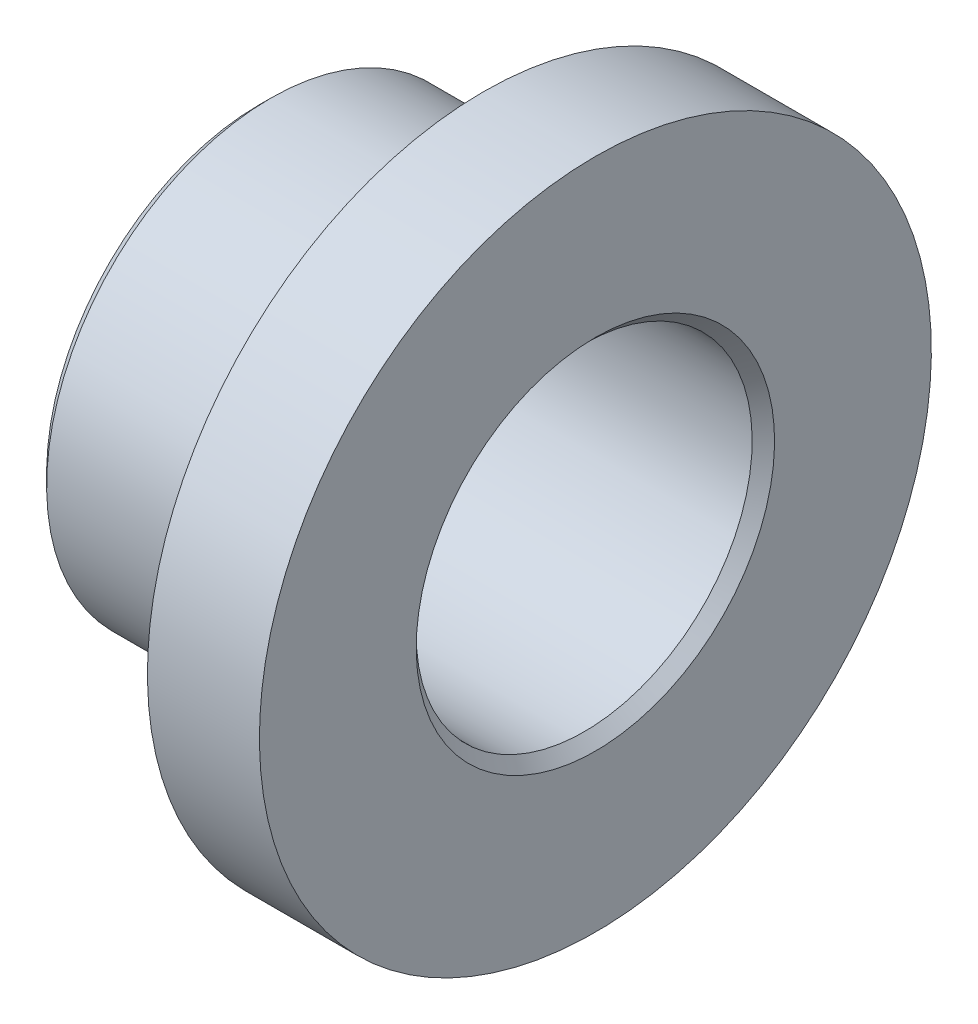
ISO-10303-21;
HEADER;
FILE_DESCRIPTION(('STEP AP214'),'2;1');
FILE_NAME('part.step','',(''),(''),'','','');
FILE_SCHEMA(('AUTOMOTIVE_DESIGN { 1 0 10303 214 1 1 1 1 }'));
ENDSEC;
DATA;
#1=APPLICATION_CONTEXT('core data for automotive mechanical design processes');
#2=APPLICATION_PROTOCOL_DEFINITION('international standard','automotive_design',2000,#1);
#3=PRODUCT_CONTEXT('',#1,'mechanical');
#4=PRODUCT('Part','Part','',(#3));
#5=PRODUCT_RELATED_PRODUCT_CATEGORY('part','',(#4));
#6=PRODUCT_DEFINITION_FORMATION('','',#4);
#7=PRODUCT_DEFINITION_CONTEXT('part definition',#1,'design');
#8=PRODUCT_DEFINITION('design','',#6,#7);
#9=PRODUCT_DEFINITION_SHAPE('','',#8);
#10=(LENGTH_UNIT() NAMED_UNIT(*) SI_UNIT(.MILLI.,.METRE.));
#11=(NAMED_UNIT(*) PLANE_ANGLE_UNIT() SI_UNIT($,.RADIAN.));
#12=(NAMED_UNIT(*) SI_UNIT($,.STERADIAN.) SOLID_ANGLE_UNIT());
#13=UNCERTAINTY_MEASURE_WITH_UNIT(LENGTH_MEASURE(1.E-05),#10,'distance_accuracy_value','');
#14=(GEOMETRIC_REPRESENTATION_CONTEXT(3) GLOBAL_UNCERTAINTY_ASSIGNED_CONTEXT((#13)) GLOBAL_UNIT_ASSIGNED_CONTEXT((#10,
#11,#12)) REPRESENTATION_CONTEXT('',''));
#15=CARTESIAN_POINT('',(0.,0.,0.));
#16=DIRECTION('',(0.,0.,1.));
#17=DIRECTION('',(1.,0.,0.));
#18=AXIS2_PLACEMENT_3D('',#15,#16,#17);
#19=CARTESIAN_POINT('',(-40.,0.,0.));
#20=DIRECTION('',(1.,0.,0.));
#21=DIRECTION('',(0.,1.,0.));
#22=AXIS2_PLACEMENT_3D('',#19,#20,#21);
#23=PLANE('',#22);
#24=CARTESIAN_POINT('',(-40.,0.,0.));
#25=DIRECTION('',(1.,0.,0.));
#26=DIRECTION('',(0.,1.,0.));
#27=AXIS2_PLACEMENT_3D('',#24,#25,#26);
#28=CIRCLE('',#27,32.);
#29=CARTESIAN_POINT('',(-40.,32.,0.));
#30=VERTEX_POINT('',#29);
#31=EDGE_CURVE('E55',#30,#30,#28,.T.);
#32=ORIENTED_EDGE('',*,*,#31,.T.);
#33=EDGE_LOOP('',(#32));
#34=FACE_BOUND('',#33,.T.);
#35=CARTESIAN_POINT('',(-40.,0.,0.));
#36=DIRECTION('',(1.,0.,0.));
#37=DIRECTION('',(0.,1.,0.));
#38=AXIS2_PLACEMENT_3D('',#35,#36,#37);
#39=CIRCLE('',#38,38.);
#40=CARTESIAN_POINT('',(-40.,38.,0.));
#41=VERTEX_POINT('',#40);
#42=EDGE_CURVE('E58',#41,#41,#39,.F.);
#43=ORIENTED_EDGE('',*,*,#42,.T.);
#44=EDGE_LOOP('',(#43));
#45=FACE_BOUND('',#44,.T.);
#46=ADVANCED_FACE('F35',(#34,#45),#23,.F.);
#47=CARTESIAN_POINT('',(0.,0.,0.));
#48=DIRECTION('',(1.,0.,0.));
#49=DIRECTION('',(0.,1.,0.));
#50=AXIS2_PLACEMENT_3D('',#47,#48,#49);
#51=CYLINDRICAL_SURFACE('',#50,30.);
#52=CARTESIAN_POINT('',(-38.,0.,0.));
#53=DIRECTION('',(1.,0.,0.));
#54=DIRECTION('',(0.,1.,0.));
#55=AXIS2_PLACEMENT_3D('',#52,#53,#54);
#56=CIRCLE('',#55,30.);
#57=CARTESIAN_POINT('',(-38.,30.,0.));
#58=VERTEX_POINT('',#57);
#59=EDGE_CURVE('E46',#58,#58,#56,.F.);
#60=ORIENTED_EDGE('',*,*,#59,.T.);
#61=EDGE_LOOP('',(#60));
#62=FACE_BOUND('',#61,.T.);
#63=CARTESIAN_POINT('',(18.,0.,0.));
#64=DIRECTION('',(1.,0.,0.));
#65=DIRECTION('',(0.,1.,0.));
#66=AXIS2_PLACEMENT_3D('',#63,#64,#65);
#67=CIRCLE('',#66,30.);
#68=CARTESIAN_POINT('',(18.,30.,0.));
#69=VERTEX_POINT('',#68);
#70=EDGE_CURVE('E50',#69,#69,#67,.T.);
#71=ORIENTED_EDGE('',*,*,#70,.T.);
#72=EDGE_LOOP('',(#71));
#73=FACE_BOUND('',#72,.T.);
#74=ADVANCED_FACE('F88',(#62,#73),#51,.F.);
#75=CARTESIAN_POINT('',(20.,0.,0.));
#76=DIRECTION('',(1.,0.,0.));
#77=DIRECTION('',(0.,1.,0.));
#78=AXIS2_PLACEMENT_3D('',#75,#76,#77);
#79=PLANE('',#78);
#80=CARTESIAN_POINT('',(20.,0.,0.));
#81=DIRECTION('',(1.,0.,0.));
#82=DIRECTION('',(0.,1.,0.));
#83=AXIS2_PLACEMENT_3D('',#80,#81,#82);
#84=CIRCLE('',#83,32.);
#85=CARTESIAN_POINT('',(20.,32.,0.));
#86=VERTEX_POINT('',#85);
#87=EDGE_CURVE('E42',#86,#86,#84,.F.);
#88=ORIENTED_EDGE('',*,*,#87,.T.);
#89=EDGE_LOOP('',(#88));
#90=FACE_BOUND('',#89,.T.);
#91=CARTESIAN_POINT('',(20.,0.,0.));
#92=DIRECTION('',(1.,0.,0.));
#93=DIRECTION('',(0.,1.,0.));
#94=AXIS2_PLACEMENT_3D('',#91,#92,#93);
#95=CIRCLE('',#94,60.);
#96=CARTESIAN_POINT('',(20.,60.,0.));
#97=VERTEX_POINT('',#96);
#98=EDGE_CURVE('E61',#97,#97,#95,.T.);
#99=ORIENTED_EDGE('',*,*,#98,.T.);
#100=EDGE_LOOP('',(#99));
#101=FACE_BOUND('',#100,.T.);
#102=ADVANCED_FACE('F94',(#90,#101),#79,.T.);
#103=CARTESIAN_POINT('',(0.,0.,0.));
#104=DIRECTION('',(1.,0.,0.));
#105=DIRECTION('',(0.,1.,0.));
#106=AXIS2_PLACEMENT_3D('',#103,#104,#105);
#107=CYLINDRICAL_SURFACE('',#106,60.);
#108=ORIENTED_EDGE('',*,*,#98,.F.);
#109=EDGE_LOOP('',(#108));
#110=FACE_BOUND('',#109,.T.);
#111=CARTESIAN_POINT('',(0.,0.,0.));
#112=DIRECTION('',(1.,0.,0.));
#113=DIRECTION('',(0.,1.,0.));
#114=AXIS2_PLACEMENT_3D('',#111,#112,#113);
#115=CIRCLE('',#114,60.);
#116=CARTESIAN_POINT('',(0.,60.,0.));
#117=VERTEX_POINT('',#116);
#118=EDGE_CURVE('E64',#117,#117,#115,.T.);
#119=ORIENTED_EDGE('',*,*,#118,.T.);
#120=EDGE_LOOP('',(#119));
#121=FACE_BOUND('',#120,.T.);
#122=ADVANCED_FACE('F84',(#110,#121),#107,.T.);
#123=CARTESIAN_POINT('',(0.,0.,0.));
#124=DIRECTION('',(1.,0.,0.));
#125=DIRECTION('',(0.,1.,0.));
#126=AXIS2_PLACEMENT_3D('',#123,#124,#125);
#127=PLANE('',#126);
#128=ORIENTED_EDGE('',*,*,#118,.F.);
#129=EDGE_LOOP('',(#128));
#130=FACE_BOUND('',#129,.T.);
#131=CARTESIAN_POINT('',(0.,0.,0.));
#132=DIRECTION('',(1.,0.,0.));
#133=DIRECTION('',(0.,1.,0.));
#134=AXIS2_PLACEMENT_3D('',#131,#132,#133);
#135=CIRCLE('',#134,40.);
#136=CARTESIAN_POINT('',(0.,40.,0.));
#137=VERTEX_POINT('',#136);
#138=EDGE_CURVE('E67',#137,#137,#135,.T.);
#139=ORIENTED_EDGE('',*,*,#138,.T.);
#140=EDGE_LOOP('',(#139));
#141=FACE_BOUND('',#140,.T.);
#142=ADVANCED_FACE('F71',(#130,#141),#127,.F.);
#143=CARTESIAN_POINT('',(0.,0.,0.));
#144=DIRECTION('',(1.,0.,0.));
#145=DIRECTION('',(0.,1.,0.));
#146=AXIS2_PLACEMENT_3D('',#143,#144,#145);
#147=CYLINDRICAL_SURFACE('',#146,40.);
#148=CARTESIAN_POINT('',(-38.,0.,0.));
#149=DIRECTION('',(1.,0.,0.));
#150=DIRECTION('',(0.,1.,0.));
#151=AXIS2_PLACEMENT_3D('',#148,#149,#150);
#152=CIRCLE('',#151,40.);
#153=CARTESIAN_POINT('',(-38.,40.,0.));
#154=VERTEX_POINT('',#153);
#155=EDGE_CURVE('E10',#154,#154,#152,.T.);
#156=ORIENTED_EDGE('',*,*,#155,.T.);
#157=EDGE_LOOP('',(#156));
#158=FACE_BOUND('',#157,.T.);
#159=ORIENTED_EDGE('',*,*,#138,.F.);
#160=EDGE_LOOP('',(#159));
#161=FACE_BOUND('',#160,.T.);
#162=ADVANCED_FACE('F73',(#158,#161),#147,.T.);
#163=CARTESIAN_POINT('',(-40.,0.,0.));
#164=DIRECTION('',(-1.,0.,0.));
#165=DIRECTION('',(0.,-1.,0.));
#166=AXIS2_PLACEMENT_3D('',#163,#164,#165);
#167=CONICAL_SURFACE('',#166,32.,0.785398163397445);
#168=ORIENTED_EDGE('',*,*,#59,.F.);
#169=EDGE_LOOP('',(#168));
#170=FACE_BOUND('',#169,.T.);
#171=ORIENTED_EDGE('',*,*,#31,.F.);
#172=EDGE_LOOP('',(#171));
#173=FACE_BOUND('',#172,.T.);
#174=ADVANCED_FACE('F75',(#170,#173),#167,.F.);
#175=CARTESIAN_POINT('',(18.,0.,0.));
#176=DIRECTION('',(1.,0.,0.));
#177=DIRECTION('',(0.,1.,0.));
#178=AXIS2_PLACEMENT_3D('',#175,#176,#177);
#179=CONICAL_SURFACE('',#178,30.,0.785398163397442);
#180=ORIENTED_EDGE('',*,*,#87,.F.);
#181=EDGE_LOOP('',(#180));
#182=FACE_BOUND('',#181,.T.);
#183=ORIENTED_EDGE('',*,*,#70,.F.);
#184=EDGE_LOOP('',(#183));
#185=FACE_BOUND('',#184,.T.);
#186=ADVANCED_FACE('F81',(#182,#185),#179,.F.);
#187=CARTESIAN_POINT('',(-38.,0.,0.));
#188=DIRECTION('',(1.,0.,0.));
#189=DIRECTION('',(0.,1.,0.));
#190=AXIS2_PLACEMENT_3D('',#187,#188,#189);
#191=CONICAL_SURFACE('',#190,40.,0.785398163397454);
#192=ORIENTED_EDGE('',*,*,#42,.F.);
#193=EDGE_LOOP('',(#192));
#194=FACE_BOUND('',#193,.T.);
#195=ORIENTED_EDGE('',*,*,#155,.F.);
#196=EDGE_LOOP('',(#195));
#197=FACE_BOUND('',#196,.T.);
#198=ADVANCED_FACE('F37',(#194,#197),#191,.T.);
#199=CLOSED_SHELL('',(#46,#74,#102,#122,#142,#162,#174,#186,#198));
#200=MANIFOLD_SOLID_BREP('B2',#199);
#201=ADVANCED_BREP_SHAPE_REPRESENTATION('',(#18,#200),#14);
#202=SHAPE_DEFINITION_REPRESENTATION(#9,#201);
ENDSEC;
END-ISO-10303-21;
